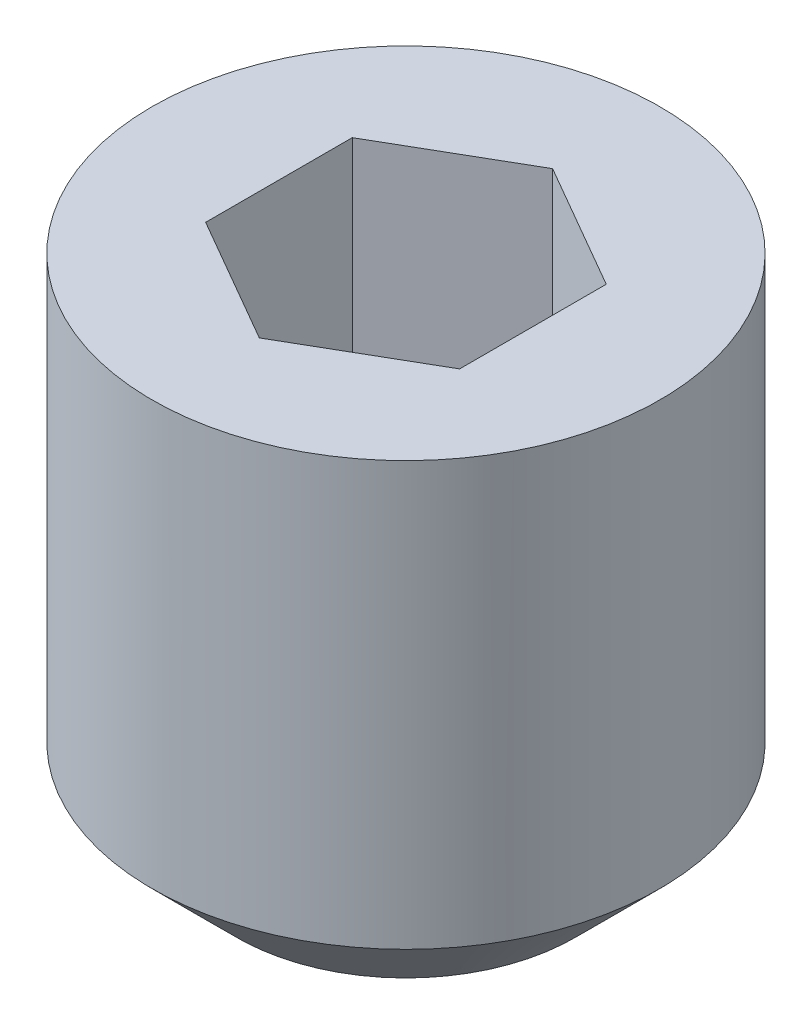
ISO-10303-21;
HEADER;
FILE_DESCRIPTION(('STEP AP214'),'2;1');
FILE_NAME('part.step','',(''),(''),'','','');
FILE_SCHEMA(('AUTOMOTIVE_DESIGN { 1 0 10303 214 1 1 1 1 }'));
ENDSEC;
DATA;
#1=APPLICATION_CONTEXT('core data for automotive mechanical design processes');
#2=APPLICATION_PROTOCOL_DEFINITION('international standard','automotive_design',2000,#1);
#3=PRODUCT_CONTEXT('',#1,'mechanical');
#4=PRODUCT('Part','Part','',(#3));
#5=PRODUCT_RELATED_PRODUCT_CATEGORY('part','',(#4));
#6=PRODUCT_DEFINITION_FORMATION('','',#4);
#7=PRODUCT_DEFINITION_CONTEXT('part definition',#1,'design');
#8=PRODUCT_DEFINITION('design','',#6,#7);
#9=PRODUCT_DEFINITION_SHAPE('','',#8);
#10=(LENGTH_UNIT() NAMED_UNIT(*) SI_UNIT(.MILLI.,.METRE.));
#11=(NAMED_UNIT(*) PLANE_ANGLE_UNIT() SI_UNIT($,.RADIAN.));
#12=(NAMED_UNIT(*) SI_UNIT($,.STERADIAN.) SOLID_ANGLE_UNIT());
#13=UNCERTAINTY_MEASURE_WITH_UNIT(LENGTH_MEASURE(1.E-05),#10,'distance_accuracy_value','');
#14=(GEOMETRIC_REPRESENTATION_CONTEXT(3) GLOBAL_UNCERTAINTY_ASSIGNED_CONTEXT((#13)) GLOBAL_UNIT_ASSIGNED_CONTEXT((#10,
#11,#12)) REPRESENTATION_CONTEXT('',''));
#15=CARTESIAN_POINT('',(0.,0.,0.));
#16=DIRECTION('',(0.,0.,1.));
#17=DIRECTION('',(1.,0.,0.));
#18=AXIS2_PLACEMENT_3D('',#15,#16,#17);
#19=CARTESIAN_POINT('',(0.,3.,0.));
#20=DIRECTION('',(0.,-1.,0.));
#21=DIRECTION('',(1.,0.,0.));
#22=AXIS2_PLACEMENT_3D('',#19,#20,#21);
#23=PLANE('',#22);
#24=CARTESIAN_POINT('',(0.,3.,0.));
#25=DIRECTION('',(0.,1.,0.));
#26=DIRECTION('',(-1.,0.,0.));
#27=AXIS2_PLACEMENT_3D('',#24,#25,#26);
#28=CIRCLE('',#27,1.5);
#29=CARTESIAN_POINT('',(-1.5,3.,0.));
#30=VERTEX_POINT('',#29);
#31=EDGE_CURVE('E11',#30,#30,#28,.T.);
#32=ORIENTED_EDGE('',*,*,#31,.T.);
#33=EDGE_LOOP('',(#32));
#34=FACE_BOUND('',#33,.T.);
#35=DIRECTION('',(-0.866025403784438,0.,0.500000000000001));
#36=VECTOR('',#35,1.);
#37=CARTESIAN_POINT('',(0.,3.,-0.866025403784439));
#38=LINE('',#37,#36);
#39=CARTESIAN_POINT('',(0.,3.,-0.866025403784439));
#40=VERTEX_POINT('',#39);
#41=CARTESIAN_POINT('',(-0.75,3.,-0.433012701892219));
#42=VERTEX_POINT('',#41);
#43=EDGE_CURVE('E149',#40,#42,#38,.T.);
#44=ORIENTED_EDGE('',*,*,#43,.F.);
#45=DIRECTION('',(-0.866025403784439,0.,-0.499999999999999));
#46=VECTOR('',#45,1.);
#47=CARTESIAN_POINT('',(0.75,3.,-0.43301270189222));
#48=LINE('',#47,#46);
#49=CARTESIAN_POINT('',(0.75,3.,-0.43301270189222));
#50=VERTEX_POINT('',#49);
#51=EDGE_CURVE('E49',#50,#40,#48,.T.);
#52=ORIENTED_EDGE('',*,*,#51,.F.);
#53=DIRECTION('',(0.,0.,-1.));
#54=VECTOR('',#53,1.);
#55=CARTESIAN_POINT('',(0.75,3.,0.433012701892219));
#56=LINE('',#55,#54);
#57=CARTESIAN_POINT('',(0.75,3.,0.433012701892219));
#58=VERTEX_POINT('',#57);
#59=EDGE_CURVE('E119',#58,#50,#56,.T.);
#60=ORIENTED_EDGE('',*,*,#59,.F.);
#61=DIRECTION('',(0.866025403784438,0.,-0.5));
#62=VECTOR('',#61,1.);
#63=CARTESIAN_POINT('',(0.,3.,0.866025403784438));
#64=LINE('',#63,#62);
#65=CARTESIAN_POINT('',(0.,3.,0.866025403784438));
#66=VERTEX_POINT('',#65);
#67=EDGE_CURVE('E157',#66,#58,#64,.T.);
#68=ORIENTED_EDGE('',*,*,#67,.F.);
#69=DIRECTION('',(0.866025403784439,0.,0.5));
#70=VECTOR('',#69,1.);
#71=CARTESIAN_POINT('',(-0.75,3.,0.433012701892219));
#72=LINE('',#71,#70);
#73=CARTESIAN_POINT('',(-0.75,3.,0.433012701892219));
#74=VERTEX_POINT('',#73);
#75=EDGE_CURVE('E154',#74,#66,#72,.T.);
#76=ORIENTED_EDGE('',*,*,#75,.F.);
#77=DIRECTION('',(0.,0.,1.));
#78=VECTOR('',#77,1.);
#79=CARTESIAN_POINT('',(-0.75,3.,-0.433012701892219));
#80=LINE('',#79,#78);
#81=EDGE_CURVE('E152',#42,#74,#80,.T.);
#82=ORIENTED_EDGE('',*,*,#81,.F.);
#83=EDGE_LOOP('',(#44,#52,#60,#68,#76,#82));
#84=FACE_BOUND('',#83,.T.);
#85=ADVANCED_FACE('F35',(#34,#84),#23,.F.);
#86=CARTESIAN_POINT('',(0.,3.,0.));
#87=DIRECTION('',(0.,1.,0.));
#88=DIRECTION('',(-1.,0.,0.));
#89=AXIS2_PLACEMENT_3D('',#86,#87,#88);
#90=CYLINDRICAL_SURFACE('',#89,1.5);
#91=CARTESIAN_POINT('',(0.,0.499999999999995,0.));
#92=DIRECTION('',(0.,-1.,0.));
#93=DIRECTION('',(0.,0.,-1.));
#94=AXIS2_PLACEMENT_3D('',#91,#92,#93);
#95=CIRCLE('',#94,1.5);
#96=CARTESIAN_POINT('',(0.,0.499999999999995,-1.5));
#97=VERTEX_POINT('',#96);
#98=EDGE_CURVE('E358',#97,#97,#95,.T.);
#99=ORIENTED_EDGE('',*,*,#98,.F.);
#100=EDGE_LOOP('',(#99));
#101=FACE_BOUND('',#100,.T.);
#102=ORIENTED_EDGE('',*,*,#31,.F.);
#103=EDGE_LOOP('',(#102));
#104=FACE_BOUND('',#103,.T.);
#105=ADVANCED_FACE('F218',(#101,#104),#90,.T.);
#106=CARTESIAN_POINT('',(0.75,1.8,-0.43301270189222));
#107=DIRECTION('',(0.499999999999999,0.,-0.866025403784439));
#108=DIRECTION('',(-0.866025403784439,0.,-0.499999999999999));
#109=AXIS2_PLACEMENT_3D('',#106,#107,#108);
#110=PLANE('',#109);
#111=DIRECTION('',(-0.866025403784439,0.,-0.499999999999999));
#112=VECTOR('',#111,1.);
#113=CARTESIAN_POINT('',(0.75,1.8,-0.43301270189222));
#114=LINE('',#113,#112);
#115=CARTESIAN_POINT('',(0.75,1.8,-0.43301270189222));
#116=VERTEX_POINT('',#115);
#117=CARTESIAN_POINT('',(0.375,1.8,-0.649519052838329));
#118=VERTEX_POINT('',#117);
#119=EDGE_CURVE('E118',#116,#118,#114,.T.);
#120=ORIENTED_EDGE('',*,*,#119,.F.);
#121=DIRECTION('',(0.,1.,0.));
#122=VECTOR('',#121,1.);
#123=CARTESIAN_POINT('',(0.75,1.8,-0.43301270189222));
#124=LINE('',#123,#122);
#125=EDGE_CURVE('E160',#116,#50,#124,.T.);
#126=ORIENTED_EDGE('',*,*,#125,.T.);
#127=ORIENTED_EDGE('',*,*,#51,.T.);
#128=DIRECTION('',(0.,1.,0.));
#129=VECTOR('',#128,1.);
#130=CARTESIAN_POINT('',(0.,1.8,-0.866025403784439));
#131=LINE('',#130,#129);
#132=CARTESIAN_POINT('',(0.,1.8,-0.866025403784439));
#133=VERTEX_POINT('',#132);
#134=EDGE_CURVE('E121',#133,#40,#131,.T.);
#135=ORIENTED_EDGE('',*,*,#134,.F.);
#136=EDGE_CURVE('E110',#118,#133,#114,.T.);
#137=ORIENTED_EDGE('',*,*,#136,.F.);
#138=EDGE_LOOP('',(#120,#126,#127,#135,#137));
#139=FACE_BOUND('',#138,.T.);
#140=ADVANCED_FACE('F122',(#139),#110,.F.);
#141=CARTESIAN_POINT('',(0.75,1.8,0.433012701892219));
#142=DIRECTION('',(1.,0.,0.));
#143=DIRECTION('',(0.,0.,-1.));
#144=AXIS2_PLACEMENT_3D('',#141,#142,#143);
#145=PLANE('',#144);
#146=DIRECTION('',(0.,0.,-1.));
#147=VECTOR('',#146,1.);
#148=CARTESIAN_POINT('',(0.75,1.8,0.433012701892219));
#149=LINE('',#148,#147);
#150=CARTESIAN_POINT('',(0.75,1.8,0.433012701892219));
#151=VERTEX_POINT('',#150);
#152=CARTESIAN_POINT('',(0.75,1.8,0.));
#153=VERTEX_POINT('',#152);
#154=EDGE_CURVE('E126',#151,#153,#149,.T.);
#155=ORIENTED_EDGE('',*,*,#154,.F.);
#156=DIRECTION('',(0.,1.,0.));
#157=VECTOR('',#156,1.);
#158=CARTESIAN_POINT('',(0.75,1.8,0.433012701892219));
#159=LINE('',#158,#157);
#160=EDGE_CURVE('E163',#151,#58,#159,.T.);
#161=ORIENTED_EDGE('',*,*,#160,.T.);
#162=ORIENTED_EDGE('',*,*,#59,.T.);
#163=ORIENTED_EDGE('',*,*,#125,.F.);
#164=EDGE_CURVE('E145',#153,#116,#149,.T.);
#165=ORIENTED_EDGE('',*,*,#164,.F.);
#166=EDGE_LOOP('',(#155,#161,#162,#163,#165));
#167=FACE_BOUND('',#166,.T.);
#168=ADVANCED_FACE('F191',(#167),#145,.F.);
#169=CARTESIAN_POINT('',(0.,1.8,0.866025403784438));
#170=DIRECTION('',(0.500000000000001,0.,0.866025403784438));
#171=DIRECTION('',(0.866025403784438,0.,-0.500000000000001));
#172=AXIS2_PLACEMENT_3D('',#169,#170,#171);
#173=PLANE('',#172);
#174=DIRECTION('',(0.866025403784438,0.,-0.5));
#175=VECTOR('',#174,1.);
#176=CARTESIAN_POINT('',(0.,1.8,0.866025403784438));
#177=LINE('',#176,#175);
#178=CARTESIAN_POINT('',(0.,1.8,0.866025403784438));
#179=VERTEX_POINT('',#178);
#180=CARTESIAN_POINT('',(0.375000000000001,1.8,0.649519052838329));
#181=VERTEX_POINT('',#180);
#182=EDGE_CURVE('E57',#179,#181,#177,.T.);
#183=ORIENTED_EDGE('',*,*,#182,.F.);
#184=DIRECTION('',(0.,1.,0.));
#185=VECTOR('',#184,1.);
#186=CARTESIAN_POINT('',(0.,1.8,0.866025403784438));
#187=LINE('',#186,#185);
#188=EDGE_CURVE('E166',#179,#66,#187,.T.);
#189=ORIENTED_EDGE('',*,*,#188,.T.);
#190=ORIENTED_EDGE('',*,*,#67,.T.);
#191=ORIENTED_EDGE('',*,*,#160,.F.);
#192=EDGE_CURVE('E143',#181,#151,#177,.T.);
#193=ORIENTED_EDGE('',*,*,#192,.F.);
#194=EDGE_LOOP('',(#183,#189,#190,#191,#193));
#195=FACE_BOUND('',#194,.T.);
#196=ADVANCED_FACE('F246',(#195),#173,.F.);
#197=CARTESIAN_POINT('',(-0.75,1.8,0.433012701892219));
#198=DIRECTION('',(-0.5,0.,0.866025403784439));
#199=DIRECTION('',(0.866025403784439,0.,0.5));
#200=AXIS2_PLACEMENT_3D('',#197,#198,#199);
#201=PLANE('',#200);
#202=DIRECTION('',(0.866025403784439,0.,0.5));
#203=VECTOR('',#202,1.);
#204=CARTESIAN_POINT('',(-0.75,1.8,0.433012701892219));
#205=LINE('',#204,#203);
#206=CARTESIAN_POINT('',(-0.75,1.8,0.433012701892219));
#207=VERTEX_POINT('',#206);
#208=CARTESIAN_POINT('',(-0.375,1.8,0.649519052838329));
#209=VERTEX_POINT('',#208);
#210=EDGE_CURVE('E140',#207,#209,#205,.T.);
#211=ORIENTED_EDGE('',*,*,#210,.F.);
#212=DIRECTION('',(0.,1.,0.));
#213=VECTOR('',#212,1.);
#214=CARTESIAN_POINT('',(-0.75,1.8,0.433012701892219));
#215=LINE('',#214,#213);
#216=EDGE_CURVE('E169',#207,#74,#215,.T.);
#217=ORIENTED_EDGE('',*,*,#216,.T.);
#218=ORIENTED_EDGE('',*,*,#75,.T.);
#219=ORIENTED_EDGE('',*,*,#188,.F.);
#220=EDGE_CURVE('E139',#209,#179,#205,.T.);
#221=ORIENTED_EDGE('',*,*,#220,.F.);
#222=EDGE_LOOP('',(#211,#217,#218,#219,#221));
#223=FACE_BOUND('',#222,.T.);
#224=ADVANCED_FACE('F243',(#223),#201,.F.);
#225=CARTESIAN_POINT('',(-0.75,1.8,-0.433012701892219));
#226=DIRECTION('',(-1.,0.,0.));
#227=DIRECTION('',(0.,-1.,0.));
#228=AXIS2_PLACEMENT_3D('',#225,#226,#227);
#229=PLANE('',#228);
#230=DIRECTION('',(0.,0.,1.));
#231=VECTOR('',#230,1.);
#232=CARTESIAN_POINT('',(-0.75,1.8,-0.433012701892219));
#233=LINE('',#232,#231);
#234=CARTESIAN_POINT('',(-0.75,1.8,-0.433012701892219));
#235=VERTEX_POINT('',#234);
#236=CARTESIAN_POINT('',(-0.75,1.8,0.));
#237=VERTEX_POINT('',#236);
#238=EDGE_CURVE('E134',#235,#237,#233,.T.);
#239=ORIENTED_EDGE('',*,*,#238,.F.);
#240=DIRECTION('',(0.,1.,0.));
#241=VECTOR('',#240,1.);
#242=CARTESIAN_POINT('',(-0.75,1.8,-0.433012701892219));
#243=LINE('',#242,#241);
#244=EDGE_CURVE('E125',#235,#42,#243,.T.);
#245=ORIENTED_EDGE('',*,*,#244,.T.);
#246=ORIENTED_EDGE('',*,*,#81,.T.);
#247=ORIENTED_EDGE('',*,*,#216,.F.);
#248=EDGE_CURVE('E132',#237,#207,#233,.T.);
#249=ORIENTED_EDGE('',*,*,#248,.F.);
#250=EDGE_LOOP('',(#239,#245,#246,#247,#249));
#251=FACE_BOUND('',#250,.T.);
#252=ADVANCED_FACE('F201',(#251),#229,.F.);
#253=CARTESIAN_POINT('',(0.,1.8,-0.866025403784439));
#254=DIRECTION('',(-0.500000000000001,0.,-0.866025403784438));
#255=DIRECTION('',(-0.866025403784438,0.,0.500000000000001));
#256=AXIS2_PLACEMENT_3D('',#253,#254,#255);
#257=PLANE('',#256);
#258=DIRECTION('',(-0.866025403784438,0.,0.500000000000001));
#259=VECTOR('',#258,1.);
#260=CARTESIAN_POINT('',(0.,1.8,-0.866025403784439));
#261=LINE('',#260,#259);
#262=CARTESIAN_POINT('',(-0.375,1.8,-0.649519052838329));
#263=VERTEX_POINT('',#262);
#264=EDGE_CURVE('E113',#133,#263,#261,.T.);
#265=ORIENTED_EDGE('',*,*,#264,.F.);
#266=ORIENTED_EDGE('',*,*,#134,.T.);
#267=ORIENTED_EDGE('',*,*,#43,.T.);
#268=ORIENTED_EDGE('',*,*,#244,.F.);
#269=EDGE_CURVE('E131',#263,#235,#261,.T.);
#270=ORIENTED_EDGE('',*,*,#269,.F.);
#271=EDGE_LOOP('',(#265,#266,#267,#268,#270));
#272=FACE_BOUND('',#271,.T.);
#273=ADVANCED_FACE('F129',(#272),#257,.F.);
#274=CARTESIAN_POINT('',(0.,1.8,0.));
#275=DIRECTION('',(0.,1.,0.));
#276=DIRECTION('',(0.,0.,1.));
#277=AXIS2_PLACEMENT_3D('',#274,#275,#276);
#278=PLANE('',#277);
#279=ORIENTED_EDGE('',*,*,#192,.T.);
#280=ORIENTED_EDGE('',*,*,#154,.T.);
#281=CARTESIAN_POINT('',(0.,1.8,0.));
#282=DIRECTION('',(0.,1.,0.));
#283=DIRECTION('',(-1.,0.,0.));
#284=AXIS2_PLACEMENT_3D('',#281,#282,#283);
#285=CIRCLE('',#284,0.75);
#286=EDGE_CURVE('E178',#181,#153,#285,.T.);
#287=ORIENTED_EDGE('',*,*,#286,.F.);
#288=EDGE_LOOP('',(#279,#280,#287));
#289=FACE_BOUND('',#288,.T.);
#290=ADVANCED_FACE('F186',(#289),#278,.T.);
#291=ORIENTED_EDGE('',*,*,#164,.T.);
#292=ORIENTED_EDGE('',*,*,#119,.T.);
#293=EDGE_CURVE('E179',#153,#118,#285,.T.);
#294=ORIENTED_EDGE('',*,*,#293,.F.);
#295=EDGE_LOOP('',(#291,#292,#294));
#296=FACE_BOUND('',#295,.T.);
#297=ADVANCED_FACE('F195',(#296),#278,.T.);
#298=ORIENTED_EDGE('',*,*,#136,.T.);
#299=ORIENTED_EDGE('',*,*,#264,.T.);
#300=EDGE_CURVE('E115',#118,#263,#285,.T.);
#301=ORIENTED_EDGE('',*,*,#300,.F.);
#302=EDGE_LOOP('',(#298,#299,#301));
#303=FACE_BOUND('',#302,.T.);
#304=ADVANCED_FACE('F111',(#303),#278,.T.);
#305=ORIENTED_EDGE('',*,*,#269,.T.);
#306=ORIENTED_EDGE('',*,*,#238,.T.);
#307=EDGE_CURVE('E162',#263,#237,#285,.T.);
#308=ORIENTED_EDGE('',*,*,#307,.F.);
#309=EDGE_LOOP('',(#305,#306,#308));
#310=FACE_BOUND('',#309,.T.);
#311=ADVANCED_FACE('F205',(#310),#278,.T.);
#312=ORIENTED_EDGE('',*,*,#248,.T.);
#313=ORIENTED_EDGE('',*,*,#210,.T.);
#314=EDGE_CURVE('E42',#237,#209,#285,.T.);
#315=ORIENTED_EDGE('',*,*,#314,.F.);
#316=EDGE_LOOP('',(#312,#313,#315));
#317=FACE_BOUND('',#316,.T.);
#318=ADVANCED_FACE('F207',(#317),#278,.T.);
#319=ORIENTED_EDGE('',*,*,#220,.T.);
#320=ORIENTED_EDGE('',*,*,#182,.T.);
#321=EDGE_CURVE('E174',#209,#181,#285,.T.);
#322=ORIENTED_EDGE('',*,*,#321,.F.);
#323=EDGE_LOOP('',(#319,#320,#322));
#324=FACE_BOUND('',#323,.T.);
#325=ADVANCED_FACE('F213',(#324),#278,.T.);
#326=CARTESIAN_POINT('',(0.,1.36698729810778,0.));
#327=DIRECTION('',(0.,1.,0.));
#328=DIRECTION('',(-1.,0.,0.));
#329=AXIS2_PLACEMENT_3D('',#326,#327,#328);
#330=CONICAL_SURFACE('',#329,0.,1.0471975511966);
#331=ORIENTED_EDGE('',*,*,#314,.T.);
#332=ORIENTED_EDGE('',*,*,#321,.T.);
#333=ORIENTED_EDGE('',*,*,#286,.T.);
#334=ORIENTED_EDGE('',*,*,#293,.T.);
#335=ORIENTED_EDGE('',*,*,#300,.T.);
#336=ORIENTED_EDGE('',*,*,#307,.T.);
#337=EDGE_LOOP('',(#331,#332,#333,#334,#335,#336));
#338=FACE_BOUND('',#337,.T.);
#339=CARTESIAN_POINT('',(0.,1.36698729810778,0.));
#340=VERTEX_POINT('',#339);
#341=VERTEX_LOOP('',#340);
#342=FACE_BOUND('',#341,.T.);
#343=ADVANCED_FACE('F183',(#338,#342),#330,.F.);
#344=CARTESIAN_POINT('',(0.,0.499999999999995,0.));
#345=DIRECTION('',(0.,1.,0.));
#346=DIRECTION('',(0.,0.,1.));
#347=AXIS2_PLACEMENT_3D('',#344,#345,#346);
#348=CONICAL_SURFACE('',#347,1.5,0.785398163397454);
#349=CARTESIAN_POINT('',(0.,0.,0.));
#350=DIRECTION('',(0.,-1.,0.));
#351=DIRECTION('',(0.,0.,-1.));
#352=AXIS2_PLACEMENT_3D('',#349,#350,#351);
#353=CIRCLE('',#352,1.);
#354=CARTESIAN_POINT('',(0.,0.,-1.));
#355=VERTEX_POINT('',#354);
#356=EDGE_CURVE('E150',#355,#355,#353,.T.);
#357=ORIENTED_EDGE('',*,*,#356,.F.);
#358=EDGE_LOOP('',(#357));
#359=FACE_BOUND('',#358,.T.);
#360=ORIENTED_EDGE('',*,*,#98,.T.);
#361=EDGE_LOOP('',(#360));
#362=FACE_BOUND('',#361,.T.);
#363=ADVANCED_FACE('F235',(#359,#362),#348,.T.);
#364=CARTESIAN_POINT('',(1.5,0.,0.));
#365=DIRECTION('',(0.,1.,0.));
#366=DIRECTION('',(-1.,0.,0.));
#367=AXIS2_PLACEMENT_3D('',#364,#365,#366);
#368=PLANE('',#367);
#369=ORIENTED_EDGE('',*,*,#356,.T.);
#370=EDGE_LOOP('',(#369));
#371=FACE_BOUND('',#370,.T.);
#372=ADVANCED_FACE('F232',(#371),#368,.F.);
#373=CLOSED_SHELL('',(#85,#105,#140,#168,#196,#224,#252,#273,#290,#297,#304,#311,#318,#325,#343,
#363,#372));
#374=MANIFOLD_SOLID_BREP('B2',#373);
#375=ADVANCED_BREP_SHAPE_REPRESENTATION('',(#18,#374),#14);
#376=SHAPE_DEFINITION_REPRESENTATION(#9,#375);
ENDSEC;
END-ISO-10303-21;
